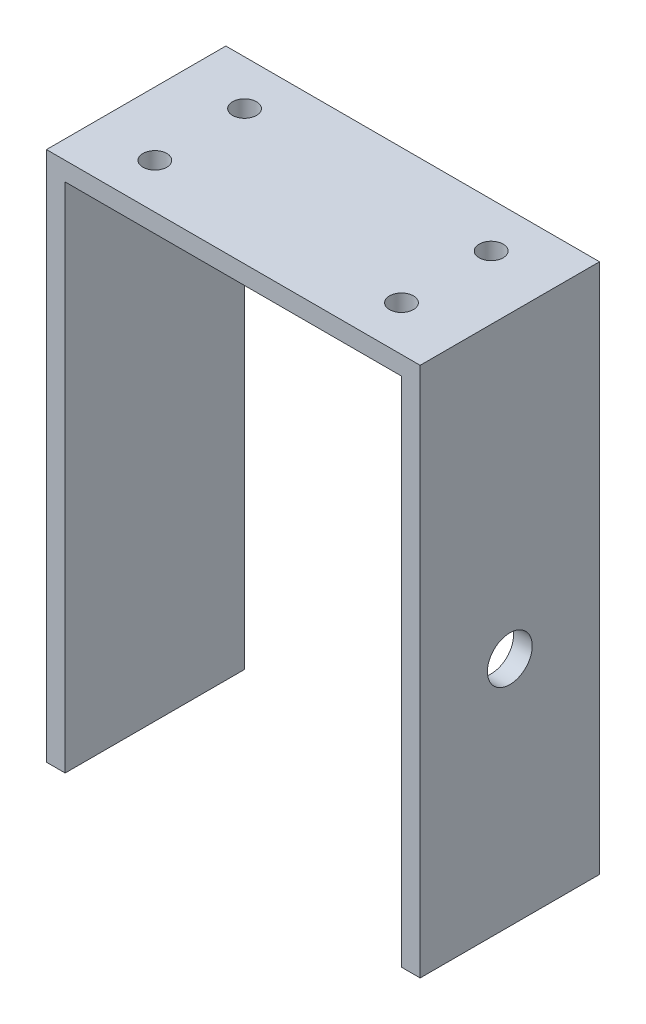
ISO-10303-21;
HEADER;
FILE_DESCRIPTION(('STEP AP214'),'2;1');
FILE_NAME('part.step','',(''),(''),'','','');
FILE_SCHEMA(('AUTOMOTIVE_DESIGN { 1 0 10303 214 1 1 1 1 }'));
ENDSEC;
DATA;
#1=APPLICATION_CONTEXT('core data for automotive mechanical design processes');
#2=APPLICATION_PROTOCOL_DEFINITION('international standard','automotive_design',2000,#1);
#3=PRODUCT_CONTEXT('',#1,'mechanical');
#4=PRODUCT('Part','Part','',(#3));
#5=PRODUCT_RELATED_PRODUCT_CATEGORY('part','',(#4));
#6=PRODUCT_DEFINITION_FORMATION('','',#4);
#7=PRODUCT_DEFINITION_CONTEXT('part definition',#1,'design');
#8=PRODUCT_DEFINITION('design','',#6,#7);
#9=PRODUCT_DEFINITION_SHAPE('','',#8);
#10=(LENGTH_UNIT() NAMED_UNIT(*) SI_UNIT(.MILLI.,.METRE.));
#11=(NAMED_UNIT(*) PLANE_ANGLE_UNIT() SI_UNIT($,.RADIAN.));
#12=(NAMED_UNIT(*) SI_UNIT($,.STERADIAN.) SOLID_ANGLE_UNIT());
#13=UNCERTAINTY_MEASURE_WITH_UNIT(LENGTH_MEASURE(1.E-05),#10,'distance_accuracy_value','');
#14=(GEOMETRIC_REPRESENTATION_CONTEXT(3) GLOBAL_UNCERTAINTY_ASSIGNED_CONTEXT((#13)) GLOBAL_UNIT_ASSIGNED_CONTEXT((#10,
#11,#12)) REPRESENTATION_CONTEXT('',''));
#15=CARTESIAN_POINT('',(0.,0.,0.));
#16=DIRECTION('',(0.,0.,1.));
#17=DIRECTION('',(1.,0.,0.));
#18=AXIS2_PLACEMENT_3D('',#15,#16,#17);
#19=CARTESIAN_POINT('',(0.,0.,24.));
#20=DIRECTION('',(0.,0.,1.));
#21=DIRECTION('',(1.,0.,0.));
#22=AXIS2_PLACEMENT_3D('',#19,#20,#21);
#23=PLANE('',#22);
#24=DIRECTION('',(0.,-1.,0.));
#25=VECTOR('',#24,1.);
#26=CARTESIAN_POINT('',(-25.,50.,24.));
#27=LINE('',#26,#25);
#28=CARTESIAN_POINT('',(-25.,50.,24.));
#29=VERTEX_POINT('',#28);
#30=CARTESIAN_POINT('',(-25.,-21.,24.));
#31=VERTEX_POINT('',#30);
#32=EDGE_CURVE('E130',#29,#31,#27,.T.);
#33=ORIENTED_EDGE('',*,*,#32,.T.);
#34=DIRECTION('',(-1.,0.,0.));
#35=VECTOR('',#34,1.);
#36=CARTESIAN_POINT('',(25.,-21.,24.));
#37=LINE('',#36,#35);
#38=CARTESIAN_POINT('',(-22.5,-21.,24.));
#39=VERTEX_POINT('',#38);
#40=EDGE_CURVE('E99',#39,#31,#37,.T.);
#41=ORIENTED_EDGE('',*,*,#40,.F.);
#42=DIRECTION('',(0.,-1.,0.));
#43=VECTOR('',#42,1.);
#44=CARTESIAN_POINT('',(-22.5,47.5,24.));
#45=LINE('',#44,#43);
#46=CARTESIAN_POINT('',(-22.5,47.5,24.));
#47=VERTEX_POINT('',#46);
#48=EDGE_CURVE('E159',#47,#39,#45,.T.);
#49=ORIENTED_EDGE('',*,*,#48,.F.);
#50=DIRECTION('',(-1.,0.,0.));
#51=VECTOR('',#50,1.);
#52=CARTESIAN_POINT('',(-22.5,47.5,24.));
#53=LINE('',#52,#51);
#54=CARTESIAN_POINT('',(22.5,47.5,24.));
#55=VERTEX_POINT('',#54);
#56=EDGE_CURVE('E165',#55,#47,#53,.T.);
#57=ORIENTED_EDGE('',*,*,#56,.F.);
#58=DIRECTION('',(0.,1.,0.));
#59=VECTOR('',#58,1.);
#60=CARTESIAN_POINT('',(22.5,47.5,24.));
#61=LINE('',#60,#59);
#62=CARTESIAN_POINT('',(22.5,-21.,24.));
#63=VERTEX_POINT('',#62);
#64=EDGE_CURVE('E162',#63,#55,#61,.T.);
#65=ORIENTED_EDGE('',*,*,#64,.F.);
#66=CARTESIAN_POINT('',(25.,-21.,24.));
#67=VERTEX_POINT('',#66);
#68=EDGE_CURVE('E57',#67,#63,#37,.T.);
#69=ORIENTED_EDGE('',*,*,#68,.F.);
#70=DIRECTION('',(0.,1.,0.));
#71=VECTOR('',#70,1.);
#72=CARTESIAN_POINT('',(25.,50.,24.));
#73=LINE('',#72,#71);
#74=CARTESIAN_POINT('',(25.,50.,24.));
#75=VERTEX_POINT('',#74);
#76=EDGE_CURVE('E120',#67,#75,#73,.T.);
#77=ORIENTED_EDGE('',*,*,#76,.T.);
#78=DIRECTION('',(-1.,0.,0.));
#79=VECTOR('',#78,1.);
#80=CARTESIAN_POINT('',(-25.,50.,24.));
#81=LINE('',#80,#79);
#82=EDGE_CURVE('E123',#75,#29,#81,.T.);
#83=ORIENTED_EDGE('',*,*,#82,.T.);
#84=EDGE_LOOP('',(#33,#41,#49,#57,#65,#69,#77,#83));
#85=FACE_BOUND('',#84,.T.);
#86=ADVANCED_FACE('F34',(#85),#23,.T.);
#87=CARTESIAN_POINT('',(0.,0.,0.));
#88=DIRECTION('',(0.,0.,1.));
#89=DIRECTION('',(1.,0.,0.));
#90=AXIS2_PLACEMENT_3D('',#87,#88,#89);
#91=PLANE('',#90);
#92=DIRECTION('',(1.,0.,0.));
#93=VECTOR('',#92,1.);
#94=CARTESIAN_POINT('',(-25.,-21.,0.));
#95=LINE('',#94,#93);
#96=CARTESIAN_POINT('',(-25.,-21.,0.));
#97=VERTEX_POINT('',#96);
#98=CARTESIAN_POINT('',(-22.5,-21.,0.));
#99=VERTEX_POINT('',#98);
#100=EDGE_CURVE('E49',#97,#99,#95,.T.);
#101=ORIENTED_EDGE('',*,*,#100,.F.);
#102=DIRECTION('',(0.,-1.,0.));
#103=VECTOR('',#102,1.);
#104=CARTESIAN_POINT('',(-25.,50.,0.));
#105=LINE('',#104,#103);
#106=CARTESIAN_POINT('',(-25.,50.,0.));
#107=VERTEX_POINT('',#106);
#108=EDGE_CURVE('E111',#107,#97,#105,.T.);
#109=ORIENTED_EDGE('',*,*,#108,.F.);
#110=DIRECTION('',(-1.,0.,0.));
#111=VECTOR('',#110,1.);
#112=CARTESIAN_POINT('',(-25.,50.,0.));
#113=LINE('',#112,#111);
#114=CARTESIAN_POINT('',(25.,50.,0.));
#115=VERTEX_POINT('',#114);
#116=EDGE_CURVE('E121',#115,#107,#113,.T.);
#117=ORIENTED_EDGE('',*,*,#116,.F.);
#118=DIRECTION('',(0.,1.,0.));
#119=VECTOR('',#118,1.);
#120=CARTESIAN_POINT('',(25.,50.,0.));
#121=LINE('',#120,#119);
#122=CARTESIAN_POINT('',(25.,-21.,0.));
#123=VERTEX_POINT('',#122);
#124=EDGE_CURVE('E125',#123,#115,#121,.T.);
#125=ORIENTED_EDGE('',*,*,#124,.F.);
#126=CARTESIAN_POINT('',(22.5,-21.,0.));
#127=VERTEX_POINT('',#126);
#128=EDGE_CURVE('E104',#127,#123,#95,.T.);
#129=ORIENTED_EDGE('',*,*,#128,.F.);
#130=DIRECTION('',(0.,1.,0.));
#131=VECTOR('',#130,1.);
#132=CARTESIAN_POINT('',(22.5,47.5,0.));
#133=LINE('',#132,#131);
#134=CARTESIAN_POINT('',(22.5,47.5,0.));
#135=VERTEX_POINT('',#134);
#136=EDGE_CURVE('E169',#127,#135,#133,.T.);
#137=ORIENTED_EDGE('',*,*,#136,.T.);
#138=DIRECTION('',(-1.,0.,0.));
#139=VECTOR('',#138,1.);
#140=CARTESIAN_POINT('',(-22.5,47.5,0.));
#141=LINE('',#140,#139);
#142=CARTESIAN_POINT('',(-22.5,47.5,0.));
#143=VERTEX_POINT('',#142);
#144=EDGE_CURVE('E163',#135,#143,#141,.T.);
#145=ORIENTED_EDGE('',*,*,#144,.T.);
#146=DIRECTION('',(0.,-1.,0.));
#147=VECTOR('',#146,1.);
#148=CARTESIAN_POINT('',(-22.5,47.5,0.));
#149=LINE('',#148,#147);
#150=EDGE_CURVE('E113',#143,#99,#149,.T.);
#151=ORIENTED_EDGE('',*,*,#150,.T.);
#152=EDGE_LOOP('',(#101,#109,#117,#125,#129,#137,#145,#151));
#153=FACE_BOUND('',#152,.T.);
#154=ADVANCED_FACE('F109',(#153),#91,.F.);
#155=CARTESIAN_POINT('',(25.,50.,24.));
#156=DIRECTION('',(-1.,0.,0.));
#157=DIRECTION('',(0.,-1.,0.));
#158=AXIS2_PLACEMENT_3D('',#155,#156,#157);
#159=PLANE('',#158);
#160=CARTESIAN_POINT('',(25.,9.99999999999997,12.));
#161=DIRECTION('',(-1.,0.,0.));
#162=DIRECTION('',(0.,-1.,0.));
#163=AXIS2_PLACEMENT_3D('',#160,#161,#162);
#164=CIRCLE('',#163,3.);
#165=CARTESIAN_POINT('',(25.,6.99999999999997,12.));
#166=VERTEX_POINT('',#165);
#167=EDGE_CURVE('E137',#166,#166,#164,.F.);
#168=ORIENTED_EDGE('',*,*,#167,.F.);
#169=EDGE_LOOP('',(#168));
#170=FACE_BOUND('',#169,.T.);
#171=DIRECTION('',(0.,0.,1.));
#172=VECTOR('',#171,1.);
#173=CARTESIAN_POINT('',(25.,-21.,0.));
#174=LINE('',#173,#172);
#175=EDGE_CURVE('E114',#123,#67,#174,.T.);
#176=ORIENTED_EDGE('',*,*,#175,.F.);
#177=ORIENTED_EDGE('',*,*,#124,.T.);
#178=DIRECTION('',(0.,0.,-1.));
#179=VECTOR('',#178,1.);
#180=CARTESIAN_POINT('',(25.,50.,24.));
#181=LINE('',#180,#179);
#182=EDGE_CURVE('E42',#75,#115,#181,.T.);
#183=ORIENTED_EDGE('',*,*,#182,.F.);
#184=ORIENTED_EDGE('',*,*,#76,.F.);
#185=EDGE_LOOP('',(#176,#177,#183,#184));
#186=FACE_BOUND('',#185,.T.);
#187=ADVANCED_FACE('F36',(#170,#186),#159,.F.);
#188=CARTESIAN_POINT('',(-25.,50.,24.));
#189=DIRECTION('',(1.,0.,0.));
#190=DIRECTION('',(0.,1.,0.));
#191=AXIS2_PLACEMENT_3D('',#188,#189,#190);
#192=PLANE('',#191);
#193=DIRECTION('',(0.,0.,-1.));
#194=VECTOR('',#193,1.);
#195=CARTESIAN_POINT('',(-25.,-21.,24.));
#196=LINE('',#195,#194);
#197=EDGE_CURVE('E96',#31,#97,#196,.T.);
#198=ORIENTED_EDGE('',*,*,#197,.F.);
#199=ORIENTED_EDGE('',*,*,#32,.F.);
#200=DIRECTION('',(0.,0.,-1.));
#201=VECTOR('',#200,1.);
#202=CARTESIAN_POINT('',(-25.,50.,24.));
#203=LINE('',#202,#201);
#204=EDGE_CURVE('E119',#29,#107,#203,.T.);
#205=ORIENTED_EDGE('',*,*,#204,.T.);
#206=ORIENTED_EDGE('',*,*,#108,.T.);
#207=EDGE_LOOP('',(#198,#199,#205,#206));
#208=FACE_BOUND('',#207,.T.);
#209=ADVANCED_FACE('F117',(#208),#192,.F.);
#210=CARTESIAN_POINT('',(-22.5,47.5,24.));
#211=DIRECTION('',(1.,0.,0.));
#212=DIRECTION('',(0.,1.,0.));
#213=AXIS2_PLACEMENT_3D('',#210,#211,#212);
#214=PLANE('',#213);
#215=ORIENTED_EDGE('',*,*,#48,.T.);
#216=DIRECTION('',(0.,0.,-1.));
#217=VECTOR('',#216,1.);
#218=CARTESIAN_POINT('',(-22.5,-21.,24.));
#219=LINE('',#218,#217);
#220=EDGE_CURVE('E190',#39,#99,#219,.T.);
#221=ORIENTED_EDGE('',*,*,#220,.T.);
#222=ORIENTED_EDGE('',*,*,#150,.F.);
#223=DIRECTION('',(0.,0.,-1.));
#224=VECTOR('',#223,1.);
#225=CARTESIAN_POINT('',(-22.5,47.5,24.));
#226=LINE('',#225,#224);
#227=EDGE_CURVE('E167',#47,#143,#226,.T.);
#228=ORIENTED_EDGE('',*,*,#227,.F.);
#229=EDGE_LOOP('',(#215,#221,#222,#228));
#230=FACE_BOUND('',#229,.T.);
#231=ADVANCED_FACE('F227',(#230),#214,.T.);
#232=CARTESIAN_POINT('',(22.5,47.5,24.));
#233=DIRECTION('',(-1.,0.,0.));
#234=DIRECTION('',(0.,-1.,0.));
#235=AXIS2_PLACEMENT_3D('',#232,#233,#234);
#236=PLANE('',#235);
#237=CARTESIAN_POINT('',(22.5,9.99999999999997,12.));
#238=DIRECTION('',(-1.,0.,0.));
#239=DIRECTION('',(0.,-1.,0.));
#240=AXIS2_PLACEMENT_3D('',#237,#238,#239);
#241=CIRCLE('',#240,3.);
#242=CARTESIAN_POINT('',(22.5,6.99999999999997,12.));
#243=VERTEX_POINT('',#242);
#244=EDGE_CURVE('E192',#243,#243,#241,.F.);
#245=ORIENTED_EDGE('',*,*,#244,.T.);
#246=EDGE_LOOP('',(#245));
#247=FACE_BOUND('',#246,.T.);
#248=ORIENTED_EDGE('',*,*,#136,.F.);
#249=DIRECTION('',(0.,0.,1.));
#250=VECTOR('',#249,1.);
#251=CARTESIAN_POINT('',(22.5,-21.,24.));
#252=LINE('',#251,#250);
#253=EDGE_CURVE('E11',#127,#63,#252,.T.);
#254=ORIENTED_EDGE('',*,*,#253,.T.);
#255=ORIENTED_EDGE('',*,*,#64,.T.);
#256=DIRECTION('',(0.,0.,-1.));
#257=VECTOR('',#256,1.);
#258=CARTESIAN_POINT('',(22.5,47.5,24.));
#259=LINE('',#258,#257);
#260=EDGE_CURVE('E174',#55,#135,#259,.T.);
#261=ORIENTED_EDGE('',*,*,#260,.T.);
#262=EDGE_LOOP('',(#248,#254,#255,#261));
#263=FACE_BOUND('',#262,.T.);
#264=ADVANCED_FACE('F232',(#247,#263),#236,.T.);
#265=CARTESIAN_POINT('',(-25.,50.,24.));
#266=DIRECTION('',(0.,-1.,0.));
#267=DIRECTION('',(0.,0.,-1.));
#268=AXIS2_PLACEMENT_3D('',#265,#266,#267);
#269=PLANE('',#268);
#270=CARTESIAN_POINT('',(16.5,50.,6.));
#271=DIRECTION('',(0.,-1.,0.));
#272=DIRECTION('',(0.,0.,-1.));
#273=AXIS2_PLACEMENT_3D('',#270,#271,#272);
#274=CIRCLE('',#273,1.6);
#275=CARTESIAN_POINT('',(16.5,50.,4.4));
#276=VERTEX_POINT('',#275);
#277=EDGE_CURVE('E147',#276,#276,#274,.T.);
#278=ORIENTED_EDGE('',*,*,#277,.T.);
#279=EDGE_LOOP('',(#278));
#280=FACE_BOUND('',#279,.T.);
#281=CARTESIAN_POINT('',(-16.5,50.,18.));
#282=DIRECTION('',(0.,-1.,0.));
#283=DIRECTION('',(0.,0.,-1.));
#284=AXIS2_PLACEMENT_3D('',#281,#282,#283);
#285=CIRCLE('',#284,1.6);
#286=CARTESIAN_POINT('',(-16.5,50.,16.4));
#287=VERTEX_POINT('',#286);
#288=EDGE_CURVE('E144',#287,#287,#285,.T.);
#289=ORIENTED_EDGE('',*,*,#288,.T.);
#290=EDGE_LOOP('',(#289));
#291=FACE_BOUND('',#290,.T.);
#292=CARTESIAN_POINT('',(16.5,50.,18.));
#293=DIRECTION('',(0.,-1.,0.));
#294=DIRECTION('',(0.,0.,-1.));
#295=AXIS2_PLACEMENT_3D('',#292,#293,#294);
#296=CIRCLE('',#295,1.6);
#297=CARTESIAN_POINT('',(16.5,50.,16.4));
#298=VERTEX_POINT('',#297);
#299=EDGE_CURVE('E141',#298,#298,#296,.T.);
#300=ORIENTED_EDGE('',*,*,#299,.T.);
#301=EDGE_LOOP('',(#300));
#302=FACE_BOUND('',#301,.T.);
#303=CARTESIAN_POINT('',(-16.5,50.,6.));
#304=DIRECTION('',(0.,-1.,0.));
#305=DIRECTION('',(0.,0.,-1.));
#306=AXIS2_PLACEMENT_3D('',#303,#304,#305);
#307=CIRCLE('',#306,1.6);
#308=CARTESIAN_POINT('',(-16.5,50.,4.4));
#309=VERTEX_POINT('',#308);
#310=EDGE_CURVE('E136',#309,#309,#307,.T.);
#311=ORIENTED_EDGE('',*,*,#310,.T.);
#312=EDGE_LOOP('',(#311));
#313=FACE_BOUND('',#312,.T.);
#314=ORIENTED_EDGE('',*,*,#116,.T.);
#315=ORIENTED_EDGE('',*,*,#204,.F.);
#316=ORIENTED_EDGE('',*,*,#82,.F.);
#317=ORIENTED_EDGE('',*,*,#182,.T.);
#318=EDGE_LOOP('',(#314,#315,#316,#317));
#319=FACE_BOUND('',#318,.T.);
#320=ADVANCED_FACE('F186',(#280,#291,#302,#313,#319),#269,.F.);
#321=CARTESIAN_POINT('',(-22.5,47.5,24.));
#322=DIRECTION('',(0.,-1.,0.));
#323=DIRECTION('',(0.,0.,-1.));
#324=AXIS2_PLACEMENT_3D('',#321,#322,#323);
#325=PLANE('',#324);
#326=CARTESIAN_POINT('',(16.5,47.5,6.));
#327=DIRECTION('',(0.,-1.,0.));
#328=DIRECTION('',(0.,0.,-1.));
#329=AXIS2_PLACEMENT_3D('',#326,#327,#328);
#330=CIRCLE('',#329,1.6);
#331=CARTESIAN_POINT('',(16.5,47.5,4.4));
#332=VERTEX_POINT('',#331);
#333=EDGE_CURVE('E145',#332,#332,#330,.T.);
#334=ORIENTED_EDGE('',*,*,#333,.F.);
#335=EDGE_LOOP('',(#334));
#336=FACE_BOUND('',#335,.T.);
#337=CARTESIAN_POINT('',(-16.5,47.5,18.));
#338=DIRECTION('',(0.,-1.,0.));
#339=DIRECTION('',(0.,0.,-1.));
#340=AXIS2_PLACEMENT_3D('',#337,#338,#339);
#341=CIRCLE('',#340,1.6);
#342=CARTESIAN_POINT('',(-16.5,47.5,16.4));
#343=VERTEX_POINT('',#342);
#344=EDGE_CURVE('E142',#343,#343,#341,.T.);
#345=ORIENTED_EDGE('',*,*,#344,.F.);
#346=EDGE_LOOP('',(#345));
#347=FACE_BOUND('',#346,.T.);
#348=CARTESIAN_POINT('',(16.5,47.5,18.));
#349=DIRECTION('',(0.,-1.,0.));
#350=DIRECTION('',(0.,0.,-1.));
#351=AXIS2_PLACEMENT_3D('',#348,#349,#350);
#352=CIRCLE('',#351,1.6);
#353=CARTESIAN_POINT('',(16.5,47.5,16.4));
#354=VERTEX_POINT('',#353);
#355=EDGE_CURVE('E138',#354,#354,#352,.T.);
#356=ORIENTED_EDGE('',*,*,#355,.F.);
#357=EDGE_LOOP('',(#356));
#358=FACE_BOUND('',#357,.T.);
#359=CARTESIAN_POINT('',(-16.5,47.5,6.));
#360=DIRECTION('',(0.,-1.,0.));
#361=DIRECTION('',(0.,0.,-1.));
#362=AXIS2_PLACEMENT_3D('',#359,#360,#361);
#363=CIRCLE('',#362,1.6);
#364=CARTESIAN_POINT('',(-16.5,47.5,4.4));
#365=VERTEX_POINT('',#364);
#366=EDGE_CURVE('E133',#365,#365,#363,.T.);
#367=ORIENTED_EDGE('',*,*,#366,.F.);
#368=EDGE_LOOP('',(#367));
#369=FACE_BOUND('',#368,.T.);
#370=ORIENTED_EDGE('',*,*,#144,.F.);
#371=ORIENTED_EDGE('',*,*,#260,.F.);
#372=ORIENTED_EDGE('',*,*,#56,.T.);
#373=ORIENTED_EDGE('',*,*,#227,.T.);
#374=EDGE_LOOP('',(#370,#371,#372,#373));
#375=FACE_BOUND('',#374,.T.);
#376=ADVANCED_FACE('F206',(#336,#347,#358,#369,#375),#325,.T.);
#377=CARTESIAN_POINT('',(-16.5,-50.,6.));
#378=DIRECTION('',(0.,1.,0.));
#379=DIRECTION('',(0.,0.,1.));
#380=AXIS2_PLACEMENT_3D('',#377,#378,#379);
#381=CYLINDRICAL_SURFACE('',#380,1.6);
#382=ORIENTED_EDGE('',*,*,#366,.T.);
#383=EDGE_LOOP('',(#382));
#384=FACE_BOUND('',#383,.T.);
#385=ORIENTED_EDGE('',*,*,#310,.F.);
#386=EDGE_LOOP('',(#385));
#387=FACE_BOUND('',#386,.T.);
#388=ADVANCED_FACE('F203',(#384,#387),#381,.F.);
#389=CARTESIAN_POINT('',(16.5,-50.,18.));
#390=DIRECTION('',(0.,1.,0.));
#391=DIRECTION('',(0.,0.,1.));
#392=AXIS2_PLACEMENT_3D('',#389,#390,#391);
#393=CYLINDRICAL_SURFACE('',#392,1.6);
#394=ORIENTED_EDGE('',*,*,#355,.T.);
#395=EDGE_LOOP('',(#394));
#396=FACE_BOUND('',#395,.T.);
#397=ORIENTED_EDGE('',*,*,#299,.F.);
#398=EDGE_LOOP('',(#397));
#399=FACE_BOUND('',#398,.T.);
#400=ADVANCED_FACE('F205',(#396,#399),#393,.F.);
#401=CARTESIAN_POINT('',(-16.5,-50.,18.));
#402=DIRECTION('',(0.,1.,0.));
#403=DIRECTION('',(0.,0.,1.));
#404=AXIS2_PLACEMENT_3D('',#401,#402,#403);
#405=CYLINDRICAL_SURFACE('',#404,1.6);
#406=ORIENTED_EDGE('',*,*,#344,.T.);
#407=EDGE_LOOP('',(#406));
#408=FACE_BOUND('',#407,.T.);
#409=ORIENTED_EDGE('',*,*,#288,.F.);
#410=EDGE_LOOP('',(#409));
#411=FACE_BOUND('',#410,.T.);
#412=ADVANCED_FACE('F213',(#408,#411),#405,.F.);
#413=CARTESIAN_POINT('',(16.5,-50.,6.));
#414=DIRECTION('',(0.,1.,0.));
#415=DIRECTION('',(0.,0.,1.));
#416=AXIS2_PLACEMENT_3D('',#413,#414,#415);
#417=CYLINDRICAL_SURFACE('',#416,1.6);
#418=ORIENTED_EDGE('',*,*,#333,.T.);
#419=EDGE_LOOP('',(#418));
#420=FACE_BOUND('',#419,.T.);
#421=ORIENTED_EDGE('',*,*,#277,.F.);
#422=EDGE_LOOP('',(#421));
#423=FACE_BOUND('',#422,.T.);
#424=ADVANCED_FACE('F244',(#420,#423),#417,.F.);
#425=CARTESIAN_POINT('',(25.000012,9.99999999999997,12.));
#426=DIRECTION('',(-1.,0.,0.));
#427=DIRECTION('',(0.,-1.,0.));
#428=AXIS2_PLACEMENT_3D('',#425,#426,#427);
#429=CYLINDRICAL_SURFACE('',#428,3.);
#430=ORIENTED_EDGE('',*,*,#244,.F.);
#431=EDGE_LOOP('',(#430));
#432=FACE_BOUND('',#431,.T.);
#433=ORIENTED_EDGE('',*,*,#167,.T.);
#434=EDGE_LOOP('',(#433));
#435=FACE_BOUND('',#434,.T.);
#436=ADVANCED_FACE('F246',(#432,#435),#429,.F.);
#437=CARTESIAN_POINT('',(0.,-21.,0.));
#438=DIRECTION('',(0.,-1.,0.));
#439=DIRECTION('',(0.,0.,-1.));
#440=AXIS2_PLACEMENT_3D('',#437,#438,#439);
#441=PLANE('',#440);
#442=ORIENTED_EDGE('',*,*,#128,.T.);
#443=ORIENTED_EDGE('',*,*,#175,.T.);
#444=ORIENTED_EDGE('',*,*,#68,.T.);
#445=ORIENTED_EDGE('',*,*,#253,.F.);
#446=EDGE_LOOP('',(#442,#443,#444,#445));
#447=FACE_BOUND('',#446,.T.);
#448=ADVANCED_FACE('F252',(#447),#441,.T.);
#449=ORIENTED_EDGE('',*,*,#40,.T.);
#450=ORIENTED_EDGE('',*,*,#197,.T.);
#451=ORIENTED_EDGE('',*,*,#100,.T.);
#452=ORIENTED_EDGE('',*,*,#220,.F.);
#453=EDGE_LOOP('',(#449,#450,#451,#452));
#454=FACE_BOUND('',#453,.T.);
#455=ADVANCED_FACE('F97',(#454),#441,.T.);
#456=CLOSED_SHELL('',(#86,#154,#187,#209,#231,#264,#320,#376,#388,#400,#412,#424,#436,#448,#455));
#457=MANIFOLD_SOLID_BREP('B2',#456);
#458=ADVANCED_BREP_SHAPE_REPRESENTATION('',(#18,#457),#14);
#459=SHAPE_DEFINITION_REPRESENTATION(#9,#458);
ENDSEC;
END-ISO-10303-21;
